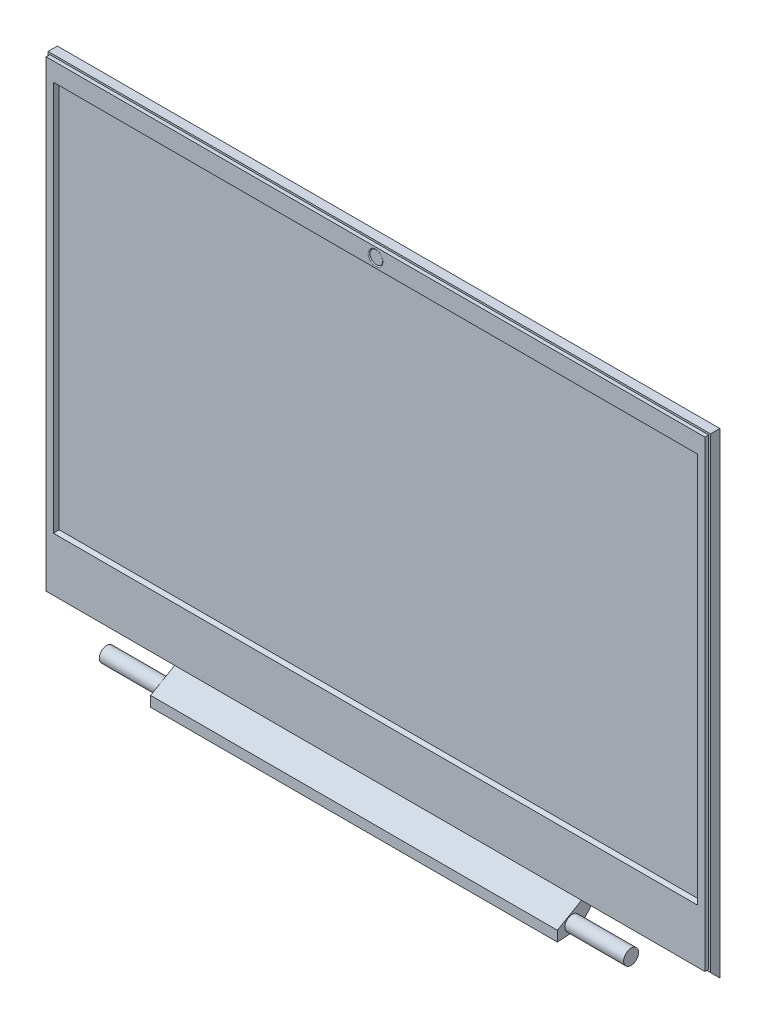
ISO-10303-21;
HEADER;
FILE_DESCRIPTION(('STEP AP214'),'2;1');
FILE_NAME('part.step','',(''),(''),'','','');
FILE_SCHEMA(('AUTOMOTIVE_DESIGN { 1 0 10303 214 1 1 1 1 }'));
ENDSEC;
DATA;
#1=APPLICATION_CONTEXT('core data for automotive mechanical design processes');
#2=APPLICATION_PROTOCOL_DEFINITION('international standard','automotive_design',2000,#1);
#3=PRODUCT_CONTEXT('',#1,'mechanical');
#4=PRODUCT('Part','Part','',(#3));
#5=PRODUCT_RELATED_PRODUCT_CATEGORY('part','',(#4));
#6=PRODUCT_DEFINITION_FORMATION('','',#4);
#7=PRODUCT_DEFINITION_CONTEXT('part definition',#1,'design');
#8=PRODUCT_DEFINITION('design','',#6,#7);
#9=PRODUCT_DEFINITION_SHAPE('','',#8);
#10=(LENGTH_UNIT() NAMED_UNIT(*) SI_UNIT(.MILLI.,.METRE.));
#11=(NAMED_UNIT(*) PLANE_ANGLE_UNIT() SI_UNIT($,.RADIAN.));
#12=(NAMED_UNIT(*) SI_UNIT($,.STERADIAN.) SOLID_ANGLE_UNIT());
#13=UNCERTAINTY_MEASURE_WITH_UNIT(LENGTH_MEASURE(1.E-05),#10,'distance_accuracy_value','');
#14=(GEOMETRIC_REPRESENTATION_CONTEXT(3) GLOBAL_UNCERTAINTY_ASSIGNED_CONTEXT((#13)) GLOBAL_UNIT_ASSIGNED_CONTEXT((#10,
#11,#12)) REPRESENTATION_CONTEXT('',''));
#15=CARTESIAN_POINT('',(0.,0.,0.));
#16=DIRECTION('',(0.,0.,1.));
#17=DIRECTION('',(1.,0.,0.));
#18=AXIS2_PLACEMENT_3D('',#15,#16,#17);
#19=CARTESIAN_POINT('',(177.5,255.,0.));
#20=DIRECTION('',(0.,-1.,0.));
#21=DIRECTION('',(0.,0.,-1.));
#22=AXIS2_PLACEMENT_3D('',#19,#20,#21);
#23=PLANE('',#22);
#24=DIRECTION('',(-1.,0.,0.));
#25=VECTOR('',#24,1.);
#26=CARTESIAN_POINT('',(177.5,255.,4.99999999999997));
#27=LINE('',#26,#25);
#28=CARTESIAN_POINT('',(177.5,255.,4.99999999999997));
#29=VERTEX_POINT('',#28);
#30=CARTESIAN_POINT('',(-177.5,255.,4.99999999999997));
#31=VERTEX_POINT('',#30);
#32=EDGE_CURVE('E294',#29,#31,#27,.T.);
#33=ORIENTED_EDGE('',*,*,#32,.F.);
#34=DIRECTION('',(0.,0.,1.));
#35=VECTOR('',#34,1.);
#36=CARTESIAN_POINT('',(177.5,255.,0.));
#37=LINE('',#36,#35);
#38=CARTESIAN_POINT('',(177.5,255.,0.));
#39=VERTEX_POINT('',#38);
#40=EDGE_CURVE('E363',#39,#29,#37,.T.);
#41=ORIENTED_EDGE('',*,*,#40,.F.);
#42=DIRECTION('',(-1.,0.,0.));
#43=VECTOR('',#42,1.);
#44=CARTESIAN_POINT('',(177.5,255.,0.));
#45=LINE('',#44,#43);
#46=CARTESIAN_POINT('',(-177.5,255.,0.));
#47=VERTEX_POINT('',#46);
#48=EDGE_CURVE('E381',#39,#47,#45,.T.);
#49=ORIENTED_EDGE('',*,*,#48,.T.);
#50=DIRECTION('',(0.,0.,1.));
#51=VECTOR('',#50,1.);
#52=CARTESIAN_POINT('',(-177.5,255.,0.));
#53=LINE('',#52,#51);
#54=EDGE_CURVE('E360',#47,#31,#53,.T.);
#55=ORIENTED_EDGE('',*,*,#54,.T.);
#56=EDGE_LOOP('',(#33,#41,#49,#55));
#57=FACE_BOUND('',#56,.T.);
#58=ADVANCED_FACE('F65',(#57),#23,.F.);
#59=CARTESIAN_POINT('',(177.5,0.,0.));
#60=DIRECTION('',(1.,0.,0.));
#61=DIRECTION('',(0.,0.,-1.));
#62=AXIS2_PLACEMENT_3D('',#59,#60,#61);
#63=PLANE('',#62);
#64=ORIENTED_EDGE('',*,*,#40,.T.);
#65=DIRECTION('',(0.,1.,0.));
#66=VECTOR('',#65,1.);
#67=CARTESIAN_POINT('',(177.5,4.99999999999995,4.99999999999997));
#68=LINE('',#67,#66);
#69=CARTESIAN_POINT('',(177.5,4.99999999999995,4.99999999999997));
#70=VERTEX_POINT('',#69);
#71=EDGE_CURVE('E282',#70,#29,#68,.T.);
#72=ORIENTED_EDGE('',*,*,#71,.F.);
#73=DIRECTION('',(0.,-0.707106781186546,-0.707106781186549));
#74=VECTOR('',#73,1.);
#75=CARTESIAN_POINT('',(177.5,4.99999999999995,4.99999999999997));
#76=LINE('',#75,#74);
#77=CARTESIAN_POINT('',(177.5,0.,0.));
#78=VERTEX_POINT('',#77);
#79=EDGE_CURVE('E355',#70,#78,#76,.T.);
#80=ORIENTED_EDGE('',*,*,#79,.T.);
#81=DIRECTION('',(0.,1.,0.));
#82=VECTOR('',#81,1.);
#83=CARTESIAN_POINT('',(177.5,0.,0.));
#84=LINE('',#83,#82);
#85=EDGE_CURVE('E359',#78,#39,#84,.T.);
#86=ORIENTED_EDGE('',*,*,#85,.T.);
#87=EDGE_LOOP('',(#64,#72,#80,#86));
#88=FACE_BOUND('',#87,.T.);
#89=ADVANCED_FACE('F463',(#88),#63,.T.);
#90=CARTESIAN_POINT('',(-177.5,0.,0.));
#91=DIRECTION('',(1.,0.,0.));
#92=DIRECTION('',(0.,0.,-1.));
#93=AXIS2_PLACEMENT_3D('',#90,#91,#92);
#94=PLANE('',#93);
#95=DIRECTION('',(0.,-1.,0.));
#96=VECTOR('',#95,1.);
#97=CARTESIAN_POINT('',(-177.5,255.,4.99999999999997));
#98=LINE('',#97,#96);
#99=CARTESIAN_POINT('',(-177.5,4.99999999999995,4.99999999999997));
#100=VERTEX_POINT('',#99);
#101=EDGE_CURVE('E297',#31,#100,#98,.T.);
#102=ORIENTED_EDGE('',*,*,#101,.F.);
#103=ORIENTED_EDGE('',*,*,#54,.F.);
#104=DIRECTION('',(0.,1.,0.));
#105=VECTOR('',#104,1.);
#106=CARTESIAN_POINT('',(-177.5,0.,0.));
#107=LINE('',#106,#105);
#108=CARTESIAN_POINT('',(-177.5,0.,0.));
#109=VERTEX_POINT('',#108);
#110=EDGE_CURVE('E371',#109,#47,#107,.T.);
#111=ORIENTED_EDGE('',*,*,#110,.F.);
#112=DIRECTION('',(0.,-0.707106781186546,-0.707106781186549));
#113=VECTOR('',#112,1.);
#114=CARTESIAN_POINT('',(-177.5,4.99999999999995,4.99999999999997));
#115=LINE('',#114,#113);
#116=EDGE_CURVE('E354',#100,#109,#115,.T.);
#117=ORIENTED_EDGE('',*,*,#116,.F.);
#118=EDGE_LOOP('',(#102,#103,#111,#117));
#119=FACE_BOUND('',#118,.T.);
#120=ADVANCED_FACE('F469',(#119),#94,.F.);
#121=CARTESIAN_POINT('',(177.5,4.99999999999995,4.99999999999997));
#122=DIRECTION('',(0.,0.707106781186549,-0.707106781186546));
#123=DIRECTION('',(0.,0.707106781186546,0.707106781186549));
#124=AXIS2_PLACEMENT_3D('',#121,#122,#123);
#125=PLANE('',#124);
#126=DIRECTION('',(0.,0.707106781186546,0.707106781186549));
#127=VECTOR('',#126,1.);
#128=CARTESIAN_POINT('',(109.,4.99999999999995,4.99999999999997));
#129=LINE('',#128,#127);
#130=CARTESIAN_POINT('',(109.,0.,0.));
#131=VERTEX_POINT('',#130);
#132=CARTESIAN_POINT('',(109.,4.99999999999995,4.99999999999997));
#133=VERTEX_POINT('',#132);
#134=EDGE_CURVE('E301',#131,#133,#129,.T.);
#135=ORIENTED_EDGE('',*,*,#134,.F.);
#136=DIRECTION('',(-1.,0.,0.));
#137=VECTOR('',#136,1.);
#138=CARTESIAN_POINT('',(177.5,0.,0.));
#139=LINE('',#138,#137);
#140=EDGE_CURVE('E386',#78,#131,#139,.T.);
#141=ORIENTED_EDGE('',*,*,#140,.F.);
#142=ORIENTED_EDGE('',*,*,#79,.F.);
#143=DIRECTION('',(-1.,0.,0.));
#144=VECTOR('',#143,1.);
#145=CARTESIAN_POINT('',(177.5,4.99999999999995,4.99999999999997));
#146=LINE('',#145,#144);
#147=EDGE_CURVE('E377',#70,#133,#146,.T.);
#148=ORIENTED_EDGE('',*,*,#147,.T.);
#149=EDGE_LOOP('',(#135,#141,#142,#148));
#150=FACE_BOUND('',#149,.T.);
#151=ADVANCED_FACE('F483',(#150),#125,.F.);
#152=CARTESIAN_POINT('',(-109.,0.,0.));
#153=VERTEX_POINT('',#152);
#154=EDGE_CURVE('E385',#153,#109,#139,.T.);
#155=ORIENTED_EDGE('',*,*,#154,.F.);
#156=DIRECTION('',(0.,0.707106781186546,0.707106781186549));
#157=VECTOR('',#156,1.);
#158=CARTESIAN_POINT('',(-109.,4.99999999999995,4.99999999999997));
#159=LINE('',#158,#157);
#160=CARTESIAN_POINT('',(-109.,4.99999999999995,4.99999999999997));
#161=VERTEX_POINT('',#160);
#162=EDGE_CURVE('E300',#153,#161,#159,.T.);
#163=ORIENTED_EDGE('',*,*,#162,.T.);
#164=EDGE_CURVE('E367',#161,#100,#146,.T.);
#165=ORIENTED_EDGE('',*,*,#164,.T.);
#166=ORIENTED_EDGE('',*,*,#116,.T.);
#167=EDGE_LOOP('',(#155,#163,#165,#166));
#168=FACE_BOUND('',#167,.T.);
#169=ADVANCED_FACE('F479',(#168),#125,.F.);
#170=CARTESIAN_POINT('',(177.5,0.,0.));
#171=DIRECTION('',(0.,0.,1.));
#172=DIRECTION('',(1.,0.,0.));
#173=AXIS2_PLACEMENT_3D('',#170,#171,#172);
#174=PLANE('',#173);
#175=ORIENTED_EDGE('',*,*,#110,.T.);
#176=ORIENTED_EDGE('',*,*,#48,.F.);
#177=ORIENTED_EDGE('',*,*,#85,.F.);
#178=ORIENTED_EDGE('',*,*,#140,.T.);
#179=DIRECTION('',(-1.,0.,0.));
#180=VECTOR('',#179,1.);
#181=CARTESIAN_POINT('',(109.,0.,0.));
#182=LINE('',#181,#180);
#183=EDGE_CURVE('E319',#131,#153,#182,.T.);
#184=ORIENTED_EDGE('',*,*,#183,.T.);
#185=ORIENTED_EDGE('',*,*,#154,.T.);
#186=EDGE_LOOP('',(#175,#176,#177,#178,#184,#185));
#187=FACE_BOUND('',#186,.T.);
#188=ADVANCED_FACE('F475',(#187),#174,.F.);
#189=CARTESIAN_POINT('',(109.,-2.82716426046485,18.5570461783121));
#190=DIRECTION('',(0.,-0.866025403784436,-0.500000000000004));
#191=DIRECTION('',(0.,0.500000000000004,-0.866025403784436));
#192=AXIS2_PLACEMENT_3D('',#189,#190,#191);
#193=PLANE('',#192);
#194=DIRECTION('',(0.,-0.500000000000004,0.866025403784436));
#195=VECTOR('',#194,1.);
#196=CARTESIAN_POINT('',(-109.,-2.82716426046485,18.5570461783121));
#197=LINE('',#196,#195);
#198=CARTESIAN_POINT('',(-109.,-2.82716426046485,18.5570461783121));
#199=VERTEX_POINT('',#198);
#200=EDGE_CURVE('E323',#161,#199,#197,.T.);
#201=ORIENTED_EDGE('',*,*,#200,.T.);
#202=DIRECTION('',(-1.,0.,0.));
#203=VECTOR('',#202,1.);
#204=CARTESIAN_POINT('',(109.,-2.82716426046485,18.5570461783121));
#205=LINE('',#204,#203);
#206=CARTESIAN_POINT('',(109.,-2.82716426046485,18.5570461783121));
#207=VERTEX_POINT('',#206);
#208=EDGE_CURVE('E346',#207,#199,#205,.T.);
#209=ORIENTED_EDGE('',*,*,#208,.F.);
#210=DIRECTION('',(0.,-0.500000000000004,0.866025403784436));
#211=VECTOR('',#210,1.);
#212=CARTESIAN_POINT('',(109.,-2.82716426046485,18.5570461783121));
#213=LINE('',#212,#211);
#214=EDGE_CURVE('E305',#133,#207,#213,.T.);
#215=ORIENTED_EDGE('',*,*,#214,.F.);
#216=DIRECTION('',(-1.,0.,0.));
#217=VECTOR('',#216,1.);
#218=CARTESIAN_POINT('',(109.,4.99999999999995,4.99999999999997));
#219=LINE('',#218,#217);
#220=EDGE_CURVE('E350',#133,#161,#219,.T.);
#221=ORIENTED_EDGE('',*,*,#220,.T.);
#222=EDGE_LOOP('',(#201,#209,#215,#221));
#223=FACE_BOUND('',#222,.T.);
#224=ADVANCED_FACE('F478',(#223),#193,.F.);
#225=CARTESIAN_POINT('',(109.,-8.32716426046485,18.5570461783121));
#226=DIRECTION('',(0.,0.,-1.));
#227=DIRECTION('',(-1.,0.,0.));
#228=AXIS2_PLACEMENT_3D('',#225,#226,#227);
#229=PLANE('',#228);
#230=DIRECTION('',(0.,-1.,0.));
#231=VECTOR('',#230,1.);
#232=CARTESIAN_POINT('',(-109.,-8.32716426046485,18.5570461783121));
#233=LINE('',#232,#231);
#234=CARTESIAN_POINT('',(-109.,-8.32716426046485,18.5570461783121));
#235=VERTEX_POINT('',#234);
#236=EDGE_CURVE('E326',#199,#235,#233,.T.);
#237=ORIENTED_EDGE('',*,*,#236,.T.);
#238=DIRECTION('',(-1.,0.,0.));
#239=VECTOR('',#238,1.);
#240=CARTESIAN_POINT('',(109.,-8.32716426046485,18.5570461783121));
#241=LINE('',#240,#239);
#242=CARTESIAN_POINT('',(109.,-8.32716426046485,18.5570461783121));
#243=VERTEX_POINT('',#242);
#244=EDGE_CURVE('E342',#243,#235,#241,.T.);
#245=ORIENTED_EDGE('',*,*,#244,.F.);
#246=DIRECTION('',(0.,-1.,0.));
#247=VECTOR('',#246,1.);
#248=CARTESIAN_POINT('',(109.,-8.32716426046485,18.5570461783121));
#249=LINE('',#248,#247);
#250=EDGE_CURVE('E309',#207,#243,#249,.T.);
#251=ORIENTED_EDGE('',*,*,#250,.F.);
#252=ORIENTED_EDGE('',*,*,#208,.T.);
#253=EDGE_LOOP('',(#237,#245,#251,#252));
#254=FACE_BOUND('',#253,.T.);
#255=ADVANCED_FACE('F575',(#254),#229,.F.);
#256=CARTESIAN_POINT('',(109.,-7.52689139364863,6.58376077543969));
#257=DIRECTION('',(0.,0.997773783572702,0.0666894055680182));
#258=DIRECTION('',(0.,-0.0666894055680182,0.997773783572702));
#259=AXIS2_PLACEMENT_3D('',#256,#257,#258);
#260=PLANE('',#259);
#261=DIRECTION('',(0.,0.0666894055680182,-0.997773783572702));
#262=VECTOR('',#261,1.);
#263=CARTESIAN_POINT('',(-109.,-7.52689139364863,6.58376077543969));
#264=LINE('',#263,#262);
#265=CARTESIAN_POINT('',(-109.,-7.52689139364863,6.58376077543969));
#266=VERTEX_POINT('',#265);
#267=EDGE_CURVE('E329',#235,#266,#264,.T.);
#268=ORIENTED_EDGE('',*,*,#267,.T.);
#269=DIRECTION('',(-1.,0.,0.));
#270=VECTOR('',#269,1.);
#271=CARTESIAN_POINT('',(109.,-7.52689139364863,6.58376077543969));
#272=LINE('',#271,#270);
#273=CARTESIAN_POINT('',(109.,-7.52689139364863,6.58376077543969));
#274=VERTEX_POINT('',#273);
#275=EDGE_CURVE('E338',#274,#266,#272,.T.);
#276=ORIENTED_EDGE('',*,*,#275,.F.);
#277=DIRECTION('',(0.,0.0666894055680182,-0.997773783572702));
#278=VECTOR('',#277,1.);
#279=CARTESIAN_POINT('',(109.,-7.52689139364863,6.58376077543969));
#280=LINE('',#279,#278);
#281=EDGE_CURVE('E312',#243,#274,#280,.T.);
#282=ORIENTED_EDGE('',*,*,#281,.F.);
#283=ORIENTED_EDGE('',*,*,#244,.T.);
#284=EDGE_LOOP('',(#268,#276,#282,#283));
#285=FACE_BOUND('',#284,.T.);
#286=ADVANCED_FACE('F571',(#285),#260,.F.);
#287=CARTESIAN_POINT('',(109.,0.,0.));
#288=DIRECTION('',(0.,0.658376077543969,0.752689139364862));
#289=DIRECTION('',(0.,-0.752689139364863,0.658376077543969));
#290=AXIS2_PLACEMENT_3D('',#287,#288,#289);
#291=PLANE('',#290);
#292=DIRECTION('',(0.,0.752689139364863,-0.658376077543969));
#293=VECTOR('',#292,1.);
#294=CARTESIAN_POINT('',(-109.,0.,0.));
#295=LINE('',#294,#293);
#296=EDGE_CURVE('E306',#266,#153,#295,.T.);
#297=ORIENTED_EDGE('',*,*,#296,.T.);
#298=ORIENTED_EDGE('',*,*,#183,.F.);
#299=DIRECTION('',(0.,0.752689139364863,-0.658376077543969));
#300=VECTOR('',#299,1.);
#301=CARTESIAN_POINT('',(109.,0.,0.));
#302=LINE('',#301,#300);
#303=EDGE_CURVE('E315',#274,#131,#302,.T.);
#304=ORIENTED_EDGE('',*,*,#303,.F.);
#305=ORIENTED_EDGE('',*,*,#275,.T.);
#306=EDGE_LOOP('',(#297,#298,#304,#305));
#307=FACE_BOUND('',#306,.T.);
#308=ADVANCED_FACE('F565',(#307),#291,.F.);
#309=CARTESIAN_POINT('',(109.,0.,0.));
#310=DIRECTION('',(-1.,0.,0.));
#311=DIRECTION('',(0.,0.,1.));
#312=AXIS2_PLACEMENT_3D('',#309,#310,#311);
#313=PLANE('',#312);
#314=CARTESIAN_POINT('',(109.,-3.38264143798815,10.5570461783121));
#315=DIRECTION('',(-1.,0.,0.));
#316=DIRECTION('',(0.,0.,1.));
#317=AXIS2_PLACEMENT_3D('',#314,#315,#316);
#318=CIRCLE('',#317,4.);
#319=CARTESIAN_POINT('',(109.,-3.38264143798815,14.5570461783121));
#320=VERTEX_POINT('',#319);
#321=EDGE_CURVE('E12',#320,#320,#318,.F.);
#322=ORIENTED_EDGE('',*,*,#321,.F.);
#323=EDGE_LOOP('',(#322));
#324=FACE_BOUND('',#323,.T.);
#325=ORIENTED_EDGE('',*,*,#134,.T.);
#326=ORIENTED_EDGE('',*,*,#214,.T.);
#327=ORIENTED_EDGE('',*,*,#250,.T.);
#328=ORIENTED_EDGE('',*,*,#281,.T.);
#329=ORIENTED_EDGE('',*,*,#303,.T.);
#330=EDGE_LOOP('',(#325,#326,#327,#328,#329));
#331=FACE_BOUND('',#330,.T.);
#332=ADVANCED_FACE('F562',(#324,#331),#313,.F.);
#333=CARTESIAN_POINT('',(-109.,0.,0.));
#334=DIRECTION('',(-1.,0.,0.));
#335=DIRECTION('',(0.,0.,1.));
#336=AXIS2_PLACEMENT_3D('',#333,#334,#335);
#337=PLANE('',#336);
#338=CARTESIAN_POINT('',(-109.,-3.38264143798815,10.5570461783121));
#339=DIRECTION('',(-1.,0.,0.));
#340=DIRECTION('',(0.,0.,1.));
#341=AXIS2_PLACEMENT_3D('',#338,#339,#340);
#342=CIRCLE('',#341,4.);
#343=CARTESIAN_POINT('',(-109.,-3.38264143798815,14.5570461783121));
#344=VERTEX_POINT('',#343);
#345=EDGE_CURVE('E69',#344,#344,#342,.F.);
#346=ORIENTED_EDGE('',*,*,#345,.T.);
#347=EDGE_LOOP('',(#346));
#348=FACE_BOUND('',#347,.T.);
#349=ORIENTED_EDGE('',*,*,#162,.F.);
#350=ORIENTED_EDGE('',*,*,#296,.F.);
#351=ORIENTED_EDGE('',*,*,#267,.F.);
#352=ORIENTED_EDGE('',*,*,#236,.F.);
#353=ORIENTED_EDGE('',*,*,#200,.F.);
#354=EDGE_LOOP('',(#349,#350,#351,#352,#353));
#355=FACE_BOUND('',#354,.T.);
#356=ADVANCED_FACE('F558',(#348,#355),#337,.T.);
#357=CARTESIAN_POINT('',(0.,0.,4.99999999999997));
#358=DIRECTION('',(0.,0.,1.));
#359=DIRECTION('',(1.,0.,0.));
#360=AXIS2_PLACEMENT_3D('',#357,#358,#359);
#361=PLANE('',#360);
#362=DIRECTION('',(1.,0.,0.));
#363=VECTOR('',#362,1.);
#364=CARTESIAN_POINT('',(-177.5,5.99999999999995,4.99999999999997));
#365=LINE('',#364,#363);
#366=CARTESIAN_POINT('',(-176.5,5.99999999999995,4.99999999999997));
#367=VERTEX_POINT('',#366);
#368=CARTESIAN_POINT('',(176.5,5.99999999999995,4.99999999999997));
#369=VERTEX_POINT('',#368);
#370=EDGE_CURVE('E260',#367,#369,#365,.T.);
#371=ORIENTED_EDGE('',*,*,#370,.F.);
#372=DIRECTION('',(0.,-1.,0.));
#373=VECTOR('',#372,1.);
#374=CARTESIAN_POINT('',(-176.5,255.,4.99999999999997));
#375=LINE('',#374,#373);
#376=CARTESIAN_POINT('',(-176.5,254.,4.99999999999997));
#377=VERTEX_POINT('',#376);
#378=EDGE_CURVE('E256',#377,#367,#375,.T.);
#379=ORIENTED_EDGE('',*,*,#378,.F.);
#380=DIRECTION('',(-1.,0.,0.));
#381=VECTOR('',#380,1.);
#382=CARTESIAN_POINT('',(177.5,254.,4.99999999999997));
#383=LINE('',#382,#381);
#384=CARTESIAN_POINT('',(176.5,254.,4.99999999999997));
#385=VERTEX_POINT('',#384);
#386=EDGE_CURVE('E251',#385,#377,#383,.T.);
#387=ORIENTED_EDGE('',*,*,#386,.F.);
#388=DIRECTION('',(0.,1.,0.));
#389=VECTOR('',#388,1.);
#390=CARTESIAN_POINT('',(176.5,4.99999999999995,4.99999999999997));
#391=LINE('',#390,#389);
#392=EDGE_CURVE('E247',#369,#385,#391,.T.);
#393=ORIENTED_EDGE('',*,*,#392,.F.);
#394=EDGE_LOOP('',(#371,#379,#387,#393));
#395=FACE_BOUND('',#394,.T.);
#396=ORIENTED_EDGE('',*,*,#71,.T.);
#397=ORIENTED_EDGE('',*,*,#32,.T.);
#398=ORIENTED_EDGE('',*,*,#101,.T.);
#399=ORIENTED_EDGE('',*,*,#164,.F.);
#400=ORIENTED_EDGE('',*,*,#220,.F.);
#401=ORIENTED_EDGE('',*,*,#147,.F.);
#402=EDGE_LOOP('',(#396,#397,#398,#399,#400,#401));
#403=FACE_BOUND('',#402,.T.);
#404=ADVANCED_FACE('F554',(#395,#403),#361,.T.);
#405=CARTESIAN_POINT('',(176.5,4.99999999999995,4.99999999999997));
#406=DIRECTION('',(1.,0.,0.));
#407=DIRECTION('',(0.,0.,-1.));
#408=AXIS2_PLACEMENT_3D('',#405,#406,#407);
#409=PLANE('',#408);
#410=DIRECTION('',(0.,1.,0.));
#411=VECTOR('',#410,1.);
#412=CARTESIAN_POINT('',(176.5,4.99999999999995,6.99999999999997));
#413=LINE('',#412,#411);
#414=CARTESIAN_POINT('',(176.5,5.99999999999995,6.99999999999997));
#415=VERTEX_POINT('',#414);
#416=CARTESIAN_POINT('',(176.5,254.,6.99999999999997));
#417=VERTEX_POINT('',#416);
#418=EDGE_CURVE('E241',#415,#417,#413,.T.);
#419=ORIENTED_EDGE('',*,*,#418,.F.);
#420=DIRECTION('',(0.,0.,1.));
#421=VECTOR('',#420,1.);
#422=CARTESIAN_POINT('',(176.5,5.99999999999995,4.99999999999997));
#423=LINE('',#422,#421);
#424=EDGE_CURVE('E279',#369,#415,#423,.T.);
#425=ORIENTED_EDGE('',*,*,#424,.F.);
#426=ORIENTED_EDGE('',*,*,#392,.T.);
#427=DIRECTION('',(0.,0.,1.));
#428=VECTOR('',#427,1.);
#429=CARTESIAN_POINT('',(176.5,254.,4.99999999999997));
#430=LINE('',#429,#428);
#431=EDGE_CURVE('E264',#385,#417,#430,.T.);
#432=ORIENTED_EDGE('',*,*,#431,.T.);
#433=EDGE_LOOP('',(#419,#425,#426,#432));
#434=FACE_BOUND('',#433,.T.);
#435=ADVANCED_FACE('F543',(#434),#409,.T.);
#436=CARTESIAN_POINT('',(-177.5,5.99999999999995,4.99999999999997));
#437=DIRECTION('',(0.,-1.,0.));
#438=DIRECTION('',(0.,0.,-1.));
#439=AXIS2_PLACEMENT_3D('',#436,#437,#438);
#440=PLANE('',#439);
#441=DIRECTION('',(1.,0.,0.));
#442=VECTOR('',#441,1.);
#443=CARTESIAN_POINT('',(-177.5,5.99999999999995,6.99999999999997));
#444=LINE('',#443,#442);
#445=CARTESIAN_POINT('',(-176.5,5.99999999999995,6.99999999999997));
#446=VERTEX_POINT('',#445);
#447=EDGE_CURVE('E252',#446,#415,#444,.T.);
#448=ORIENTED_EDGE('',*,*,#447,.F.);
#449=DIRECTION('',(0.,0.,1.));
#450=VECTOR('',#449,1.);
#451=CARTESIAN_POINT('',(-176.5,5.99999999999995,4.99999999999997));
#452=LINE('',#451,#450);
#453=EDGE_CURVE('E283',#367,#446,#452,.T.);
#454=ORIENTED_EDGE('',*,*,#453,.F.);
#455=ORIENTED_EDGE('',*,*,#370,.T.);
#456=ORIENTED_EDGE('',*,*,#424,.T.);
#457=EDGE_LOOP('',(#448,#454,#455,#456));
#458=FACE_BOUND('',#457,.T.);
#459=ADVANCED_FACE('F539',(#458),#440,.T.);
#460=CARTESIAN_POINT('',(-176.5,255.,4.99999999999997));
#461=DIRECTION('',(-1.,0.,0.));
#462=DIRECTION('',(0.,0.,1.));
#463=AXIS2_PLACEMENT_3D('',#460,#461,#462);
#464=PLANE('',#463);
#465=DIRECTION('',(0.,-1.,0.));
#466=VECTOR('',#465,1.);
#467=CARTESIAN_POINT('',(-176.5,255.,6.99999999999997));
#468=LINE('',#467,#466);
#469=CARTESIAN_POINT('',(-176.5,254.,6.99999999999997));
#470=VERTEX_POINT('',#469);
#471=EDGE_CURVE('E272',#470,#446,#468,.T.);
#472=ORIENTED_EDGE('',*,*,#471,.F.);
#473=DIRECTION('',(0.,0.,1.));
#474=VECTOR('',#473,1.);
#475=CARTESIAN_POINT('',(-176.5,254.,4.99999999999997));
#476=LINE('',#475,#474);
#477=EDGE_CURVE('E286',#377,#470,#476,.T.);
#478=ORIENTED_EDGE('',*,*,#477,.F.);
#479=ORIENTED_EDGE('',*,*,#378,.T.);
#480=ORIENTED_EDGE('',*,*,#453,.T.);
#481=EDGE_LOOP('',(#472,#478,#479,#480));
#482=FACE_BOUND('',#481,.T.);
#483=ADVANCED_FACE('F542',(#482),#464,.T.);
#484=CARTESIAN_POINT('',(177.5,254.,4.99999999999997));
#485=DIRECTION('',(0.,1.,0.));
#486=DIRECTION('',(0.,0.,1.));
#487=AXIS2_PLACEMENT_3D('',#484,#485,#486);
#488=PLANE('',#487);
#489=DIRECTION('',(-1.,0.,0.));
#490=VECTOR('',#489,1.);
#491=CARTESIAN_POINT('',(177.5,254.,6.99999999999997));
#492=LINE('',#491,#490);
#493=EDGE_CURVE('E268',#417,#470,#492,.T.);
#494=ORIENTED_EDGE('',*,*,#493,.F.);
#495=ORIENTED_EDGE('',*,*,#431,.F.);
#496=ORIENTED_EDGE('',*,*,#386,.T.);
#497=ORIENTED_EDGE('',*,*,#477,.T.);
#498=EDGE_LOOP('',(#494,#495,#496,#497));
#499=FACE_BOUND('',#498,.T.);
#500=ADVANCED_FACE('F547',(#499),#488,.T.);
#501=CARTESIAN_POINT('',(0.,0.,6.99999999999997));
#502=DIRECTION('',(0.,0.,1.));
#503=DIRECTION('',(1.,0.,0.));
#504=AXIS2_PLACEMENT_3D('',#501,#502,#503);
#505=PLANE('',#504);
#506=CARTESIAN_POINT('',(0.,249.,6.99999999999997));
#507=DIRECTION('',(0.,0.,1.));
#508=DIRECTION('',(1.,0.,0.));
#509=AXIS2_PLACEMENT_3D('',#506,#507,#508);
#510=CIRCLE('',#509,4.);
#511=CARTESIAN_POINT('',(4.,249.,6.99999999999997));
#512=VERTEX_POINT('',#511);
#513=EDGE_CURVE('E75',#512,#512,#510,.F.);
#514=ORIENTED_EDGE('',*,*,#513,.T.);
#515=EDGE_LOOP('',(#514));
#516=FACE_BOUND('',#515,.T.);
#517=DIRECTION('',(-1.,0.,0.));
#518=VECTOR('',#517,1.);
#519=CARTESIAN_POINT('',(-171.5,34.846,6.99999999999997));
#520=LINE('',#519,#518);
#521=CARTESIAN_POINT('',(172.654,34.846,6.99999999999997));
#522=VERTEX_POINT('',#521);
#523=CARTESIAN_POINT('',(-172.654,34.846,6.99999999999997));
#524=VERTEX_POINT('',#523);
#525=EDGE_CURVE('E392',#522,#524,#520,.T.);
#526=ORIENTED_EDGE('',*,*,#525,.T.);
#527=DIRECTION('',(0.,1.,0.));
#528=VECTOR('',#527,1.);
#529=CARTESIAN_POINT('',(-172.654,243.,6.99999999999997));
#530=LINE('',#529,#528);
#531=CARTESIAN_POINT('',(-172.654,244.154,6.99999999999997));
#532=VERTEX_POINT('',#531);
#533=EDGE_CURVE('E401',#524,#532,#530,.T.);
#534=ORIENTED_EDGE('',*,*,#533,.T.);
#535=DIRECTION('',(1.,0.,0.));
#536=VECTOR('',#535,1.);
#537=CARTESIAN_POINT('',(171.5,244.154,6.99999999999997));
#538=LINE('',#537,#536);
#539=CARTESIAN_POINT('',(172.654,244.154,6.99999999999997));
#540=VERTEX_POINT('',#539);
#541=EDGE_CURVE('E398',#532,#540,#538,.T.);
#542=ORIENTED_EDGE('',*,*,#541,.T.);
#543=DIRECTION('',(0.,-1.,0.));
#544=VECTOR('',#543,1.);
#545=CARTESIAN_POINT('',(172.654,36.,6.99999999999997));
#546=LINE('',#545,#544);
#547=EDGE_CURVE('E395',#540,#522,#546,.T.);
#548=ORIENTED_EDGE('',*,*,#547,.T.);
#549=EDGE_LOOP('',(#526,#534,#542,#548));
#550=FACE_BOUND('',#549,.T.);
#551=ORIENTED_EDGE('',*,*,#447,.T.);
#552=ORIENTED_EDGE('',*,*,#418,.T.);
#553=ORIENTED_EDGE('',*,*,#493,.T.);
#554=ORIENTED_EDGE('',*,*,#471,.T.);
#555=EDGE_LOOP('',(#551,#552,#553,#554));
#556=FACE_BOUND('',#555,.T.);
#557=ADVANCED_FACE('F424',(#516,#550,#556),#505,.T.);
#558=CARTESIAN_POINT('',(-171.5,36.,4.99999999999997));
#559=DIRECTION('',(-1.,0.,0.));
#560=DIRECTION('',(0.,0.,1.));
#561=AXIS2_PLACEMENT_3D('',#558,#559,#560);
#562=PLANE('',#561);
#563=DIRECTION('',(0.,0.,1.));
#564=VECTOR('',#563,1.);
#565=CARTESIAN_POINT('',(-171.5,243.,4.99999999999997));
#566=LINE('',#565,#564);
#567=CARTESIAN_POINT('',(-171.5,243.,4.99999999999997));
#568=VERTEX_POINT('',#567);
#569=CARTESIAN_POINT('',(-171.5,243.,5.00121336806555));
#570=VERTEX_POINT('',#569);
#571=EDGE_CURVE('E238',#568,#570,#566,.T.);
#572=ORIENTED_EDGE('',*,*,#571,.T.);
#573=DIRECTION('',(0.,-1.,0.));
#574=VECTOR('',#573,1.);
#575=CARTESIAN_POINT('',(-171.5,36.,5.00121336806555));
#576=LINE('',#575,#574);
#577=CARTESIAN_POINT('',(-171.5,36.,5.00121336806555));
#578=VERTEX_POINT('',#577);
#579=EDGE_CURVE('E208',#570,#578,#576,.T.);
#580=ORIENTED_EDGE('',*,*,#579,.T.);
#581=DIRECTION('',(0.,0.,1.));
#582=VECTOR('',#581,1.);
#583=CARTESIAN_POINT('',(-171.5,36.,4.99999999999997));
#584=LINE('',#583,#582);
#585=CARTESIAN_POINT('',(-171.5,36.,4.99999999999997));
#586=VERTEX_POINT('',#585);
#587=EDGE_CURVE('E200',#586,#578,#584,.T.);
#588=ORIENTED_EDGE('',*,*,#587,.F.);
#589=DIRECTION('',(0.,-1.,0.));
#590=VECTOR('',#589,1.);
#591=CARTESIAN_POINT('',(-171.5,36.,4.99999999999997));
#592=LINE('',#591,#590);
#593=EDGE_CURVE('E205',#568,#586,#592,.T.);
#594=ORIENTED_EDGE('',*,*,#593,.F.);
#595=EDGE_LOOP('',(#572,#580,#588,#594));
#596=FACE_BOUND('',#595,.T.);
#597=ADVANCED_FACE('F203',(#596),#562,.F.);
#598=CARTESIAN_POINT('',(-171.5,243.,4.99999999999997));
#599=DIRECTION('',(0.,1.,0.));
#600=DIRECTION('',(0.,0.,1.));
#601=AXIS2_PLACEMENT_3D('',#598,#599,#600);
#602=PLANE('',#601);
#603=DIRECTION('',(0.,0.,1.));
#604=VECTOR('',#603,1.);
#605=CARTESIAN_POINT('',(171.5,243.,4.99999999999997));
#606=LINE('',#605,#604);
#607=CARTESIAN_POINT('',(171.5,243.,4.99999999999997));
#608=VERTEX_POINT('',#607);
#609=CARTESIAN_POINT('',(171.5,243.,5.00121336806555));
#610=VERTEX_POINT('',#609);
#611=EDGE_CURVE('E242',#608,#610,#606,.T.);
#612=ORIENTED_EDGE('',*,*,#611,.T.);
#613=DIRECTION('',(-1.,0.,0.));
#614=VECTOR('',#613,1.);
#615=CARTESIAN_POINT('',(-171.5,243.,5.00121336806555));
#616=LINE('',#615,#614);
#617=EDGE_CURVE('E405',#610,#570,#616,.T.);
#618=ORIENTED_EDGE('',*,*,#617,.T.);
#619=ORIENTED_EDGE('',*,*,#571,.F.);
#620=DIRECTION('',(-1.,0.,0.));
#621=VECTOR('',#620,1.);
#622=CARTESIAN_POINT('',(-171.5,243.,4.99999999999997));
#623=LINE('',#622,#621);
#624=EDGE_CURVE('E211',#608,#568,#623,.T.);
#625=ORIENTED_EDGE('',*,*,#624,.F.);
#626=EDGE_LOOP('',(#612,#618,#619,#625));
#627=FACE_BOUND('',#626,.T.);
#628=ADVANCED_FACE('F526',(#627),#602,.F.);
#629=CARTESIAN_POINT('',(171.5,36.,4.99999999999997));
#630=DIRECTION('',(1.,0.,0.));
#631=DIRECTION('',(0.,0.,-1.));
#632=AXIS2_PLACEMENT_3D('',#629,#630,#631);
#633=PLANE('',#632);
#634=DIRECTION('',(0.,0.,1.));
#635=VECTOR('',#634,1.);
#636=CARTESIAN_POINT('',(171.5,36.,4.99999999999997));
#637=LINE('',#636,#635);
#638=CARTESIAN_POINT('',(171.5,36.,4.99999999999997));
#639=VERTEX_POINT('',#638);
#640=CARTESIAN_POINT('',(171.5,36.,5.00121336806555));
#641=VERTEX_POINT('',#640);
#642=EDGE_CURVE('E210',#639,#641,#637,.T.);
#643=ORIENTED_EDGE('',*,*,#642,.T.);
#644=DIRECTION('',(0.,1.,0.));
#645=VECTOR('',#644,1.);
#646=CARTESIAN_POINT('',(171.5,243.,5.00121336806555));
#647=LINE('',#646,#645);
#648=EDGE_CURVE('E90',#641,#610,#647,.T.);
#649=ORIENTED_EDGE('',*,*,#648,.T.);
#650=ORIENTED_EDGE('',*,*,#611,.F.);
#651=DIRECTION('',(0.,1.,0.));
#652=VECTOR('',#651,1.);
#653=CARTESIAN_POINT('',(171.5,36.,4.99999999999997));
#654=LINE('',#653,#652);
#655=EDGE_CURVE('E220',#639,#608,#654,.T.);
#656=ORIENTED_EDGE('',*,*,#655,.F.);
#657=EDGE_LOOP('',(#643,#649,#650,#656));
#658=FACE_BOUND('',#657,.T.);
#659=ADVANCED_FACE('F527',(#658),#633,.F.);
#660=CARTESIAN_POINT('',(-171.5,36.,4.99999999999997));
#661=DIRECTION('',(0.,-1.,0.));
#662=DIRECTION('',(0.,0.,-1.));
#663=AXIS2_PLACEMENT_3D('',#660,#661,#662);
#664=PLANE('',#663);
#665=ORIENTED_EDGE('',*,*,#587,.T.);
#666=DIRECTION('',(1.,0.,0.));
#667=VECTOR('',#666,1.);
#668=CARTESIAN_POINT('',(171.5,36.,5.00121336806555));
#669=LINE('',#668,#667);
#670=EDGE_CURVE('E83',#578,#641,#669,.T.);
#671=ORIENTED_EDGE('',*,*,#670,.T.);
#672=ORIENTED_EDGE('',*,*,#642,.F.);
#673=DIRECTION('',(1.,0.,0.));
#674=VECTOR('',#673,1.);
#675=CARTESIAN_POINT('',(-171.5,36.,4.99999999999997));
#676=LINE('',#675,#674);
#677=EDGE_CURVE('E214',#586,#639,#676,.T.);
#678=ORIENTED_EDGE('',*,*,#677,.F.);
#679=EDGE_LOOP('',(#665,#671,#672,#678));
#680=FACE_BOUND('',#679,.T.);
#681=ADVANCED_FACE('F215',(#680),#664,.F.);
#682=CARTESIAN_POINT('',(0.,0.,4.99999999999997));
#683=DIRECTION('',(0.,0.,-1.));
#684=DIRECTION('',(-1.,0.,0.));
#685=AXIS2_PLACEMENT_3D('',#682,#683,#684);
#686=PLANE('',#685);
#687=ORIENTED_EDGE('',*,*,#593,.T.);
#688=ORIENTED_EDGE('',*,*,#677,.T.);
#689=ORIENTED_EDGE('',*,*,#655,.T.);
#690=ORIENTED_EDGE('',*,*,#624,.T.);
#691=EDGE_LOOP('',(#687,#688,#689,#690));
#692=FACE_BOUND('',#691,.T.);
#693=ADVANCED_FACE('F222',(#692),#686,.F.);
#694=CARTESIAN_POINT('',(171.5,36.,5.00121336806555));
#695=DIRECTION('',(-0.866025403784434,0.,0.500000000000007));
#696=DIRECTION('',(0.,-1.,0.));
#697=AXIS2_PLACEMENT_3D('',#694,#695,#696);
#698=PLANE('',#697);
#699=DIRECTION('',(-0.447213595499963,0.447213595499963,-0.774596669241477));
#700=VECTOR('',#699,1.);
#701=CARTESIAN_POINT('',(171.5,36.,5.00121336806555));
#702=LINE('',#701,#700);
#703=EDGE_CURVE('E229',#522,#641,#702,.T.);
#704=ORIENTED_EDGE('',*,*,#703,.F.);
#705=ORIENTED_EDGE('',*,*,#547,.F.);
#706=DIRECTION('',(-0.447213595499963,-0.447213595499963,-0.774596669241477));
#707=VECTOR('',#706,1.);
#708=CARTESIAN_POINT('',(102.899999999998,174.399999999998,-113.81747203116));
#709=LINE('',#708,#707);
#710=EDGE_CURVE('E225',#610,#540,#709,.F.);
#711=ORIENTED_EDGE('',*,*,#710,.F.);
#712=ORIENTED_EDGE('',*,*,#648,.F.);
#713=EDGE_LOOP('',(#704,#705,#711,#712));
#714=FACE_BOUND('',#713,.T.);
#715=ADVANCED_FACE('F505',(#714),#698,.T.);
#716=CARTESIAN_POINT('',(-171.5,243.,5.00121336806555));
#717=DIRECTION('',(0.,-0.866025403784434,0.500000000000007));
#718=DIRECTION('',(1.,0.,0.));
#719=AXIS2_PLACEMENT_3D('',#716,#717,#718);
#720=PLANE('',#719);
#721=ORIENTED_EDGE('',*,*,#710,.T.);
#722=ORIENTED_EDGE('',*,*,#541,.F.);
#723=DIRECTION('',(0.447213595499963,-0.447213595499963,-0.774596669241477));
#724=VECTOR('',#723,1.);
#725=CARTESIAN_POINT('',(-130.099999999999,201.599999999999,-66.7056900652863));
#726=LINE('',#725,#724);
#727=EDGE_CURVE('E415',#570,#532,#726,.F.);
#728=ORIENTED_EDGE('',*,*,#727,.F.);
#729=ORIENTED_EDGE('',*,*,#617,.F.);
#730=EDGE_LOOP('',(#721,#722,#728,#729));
#731=FACE_BOUND('',#730,.T.);
#732=ADVANCED_FACE('F499',(#731),#720,.T.);
#733=CARTESIAN_POINT('',(-171.5,36.,5.00121336806555));
#734=DIRECTION('',(0.,0.866025403784434,0.500000000000007));
#735=DIRECTION('',(-1.,0.,0.));
#736=AXIS2_PLACEMENT_3D('',#733,#734,#735);
#737=PLANE('',#736);
#738=ORIENTED_EDGE('',*,*,#703,.T.);
#739=ORIENTED_EDGE('',*,*,#670,.F.);
#740=DIRECTION('',(-0.447213595499963,-0.447213595499963,0.774596669241477));
#741=VECTOR('',#740,1.);
#742=CARTESIAN_POINT('',(-171.5,36.,5.00121336806555));
#743=LINE('',#742,#741);
#744=EDGE_CURVE('E412',#524,#578,#743,.F.);
#745=ORIENTED_EDGE('',*,*,#744,.F.);
#746=ORIENTED_EDGE('',*,*,#525,.F.);
#747=EDGE_LOOP('',(#738,#739,#745,#746));
#748=FACE_BOUND('',#747,.T.);
#749=ADVANCED_FACE('F492',(#748),#737,.T.);
#750=CARTESIAN_POINT('',(-171.5,36.,5.00121336806555));
#751=DIRECTION('',(0.866025403784434,0.,0.500000000000007));
#752=DIRECTION('',(0.,1.,0.));
#753=AXIS2_PLACEMENT_3D('',#750,#751,#752);
#754=PLANE('',#753);
#755=ORIENTED_EDGE('',*,*,#727,.T.);
#756=ORIENTED_EDGE('',*,*,#533,.F.);
#757=ORIENTED_EDGE('',*,*,#744,.T.);
#758=ORIENTED_EDGE('',*,*,#579,.F.);
#759=EDGE_LOOP('',(#755,#756,#757,#758));
#760=FACE_BOUND('',#759,.T.);
#761=ADVANCED_FACE('F486',(#760),#754,.T.);
#762=CARTESIAN_POINT('',(0.,249.,6.49999999999997));
#763=DIRECTION('',(0.,0.,1.));
#764=DIRECTION('',(1.,0.,0.));
#765=AXIS2_PLACEMENT_3D('',#762,#763,#764);
#766=PLANE('',#765);
#767=CARTESIAN_POINT('',(0.,249.,6.49999999999997));
#768=DIRECTION('',(0.,0.,1.));
#769=DIRECTION('',(1.,0.,0.));
#770=AXIS2_PLACEMENT_3D('',#767,#768,#769);
#771=CIRCLE('',#770,3.5);
#772=CARTESIAN_POINT('',(3.5,249.,6.49999999999997));
#773=VERTEX_POINT('',#772);
#774=EDGE_CURVE('E232',#773,#773,#771,.T.);
#775=ORIENTED_EDGE('',*,*,#774,.T.);
#776=EDGE_LOOP('',(#775));
#777=FACE_BOUND('',#776,.T.);
#778=ADVANCED_FACE('F430',(#777),#766,.T.);
#779=CARTESIAN_POINT('',(0.,249.,6.49999999999997));
#780=DIRECTION('',(0.,0.,1.));
#781=DIRECTION('',(1.,0.,0.));
#782=AXIS2_PLACEMENT_3D('',#779,#780,#781);
#783=TOROIDAL_SURFACE('',#782,4.,0.5);
#784=ORIENTED_EDGE('',*,*,#513,.F.);
#785=EDGE_LOOP('',(#784));
#786=FACE_BOUND('',#785,.T.);
#787=ORIENTED_EDGE('',*,*,#774,.F.);
#788=EDGE_LOOP('',(#787));
#789=FACE_BOUND('',#788,.T.);
#790=ADVANCED_FACE('F67',(#786,#789),#783,.T.);
#791=CARTESIAN_POINT('',(-140.5,-3.38264143798815,10.5570461783121));
#792=DIRECTION('',(1.,0.,0.));
#793=DIRECTION('',(0.,0.,-1.));
#794=AXIS2_PLACEMENT_3D('',#791,#792,#793);
#795=PLANE('',#794);
#796=CARTESIAN_POINT('',(-140.5,-3.38264143798815,10.5570461783121));
#797=DIRECTION('',(1.,0.,0.));
#798=DIRECTION('',(0.,0.,-1.));
#799=AXIS2_PLACEMENT_3D('',#796,#797,#798);
#800=CIRCLE('',#799,4.);
#801=CARTESIAN_POINT('',(-140.5,-3.38264143798815,6.55704617831212));
#802=VERTEX_POINT('',#801);
#803=EDGE_CURVE('E442',#802,#802,#800,.T.);
#804=ORIENTED_EDGE('',*,*,#803,.F.);
#805=EDGE_LOOP('',(#804));
#806=FACE_BOUND('',#805,.T.);
#807=ADVANCED_FACE('F429',(#806),#795,.F.);
#808=CARTESIAN_POINT('',(140.5,-3.38264143798815,10.5570461783121));
#809=DIRECTION('',(-1.,0.,0.));
#810=DIRECTION('',(0.,0.,1.));
#811=AXIS2_PLACEMENT_3D('',#808,#809,#810);
#812=CYLINDRICAL_SURFACE('',#811,4.);
#813=ORIENTED_EDGE('',*,*,#345,.F.);
#814=EDGE_LOOP('',(#813));
#815=FACE_BOUND('',#814,.T.);
#816=ORIENTED_EDGE('',*,*,#803,.T.);
#817=EDGE_LOOP('',(#816));
#818=FACE_BOUND('',#817,.T.);
#819=ADVANCED_FACE('F451',(#815,#818),#812,.T.);
#820=CARTESIAN_POINT('',(140.5,-3.38264143798815,10.5570461783121));
#821=DIRECTION('',(1.,0.,0.));
#822=DIRECTION('',(0.,0.,-1.));
#823=AXIS2_PLACEMENT_3D('',#820,#821,#822);
#824=CIRCLE('',#823,4.);
#825=CARTESIAN_POINT('',(140.5,-3.38264143798815,6.55704617831212));
#826=VERTEX_POINT('',#825);
#827=EDGE_CURVE('E437',#826,#826,#824,.T.);
#828=ORIENTED_EDGE('',*,*,#827,.F.);
#829=EDGE_LOOP('',(#828));
#830=FACE_BOUND('',#829,.T.);
#831=ORIENTED_EDGE('',*,*,#321,.T.);
#832=EDGE_LOOP('',(#831));
#833=FACE_BOUND('',#832,.T.);
#834=ADVANCED_FACE('F458',(#830,#833),#812,.T.);
#835=CARTESIAN_POINT('',(140.5,-3.38264143798815,10.5570461783121));
#836=DIRECTION('',(1.,0.,0.));
#837=DIRECTION('',(0.,0.,-1.));
#838=AXIS2_PLACEMENT_3D('',#835,#836,#837);
#839=PLANE('',#838);
#840=ORIENTED_EDGE('',*,*,#827,.T.);
#841=EDGE_LOOP('',(#840));
#842=FACE_BOUND('',#841,.T.);
#843=ADVANCED_FACE('F708',(#842),#839,.T.);
#844=CLOSED_SHELL('',(#58,#89,#120,#151,#169,#188,#224,#255,#286,#308,#332,#356,#404,#435,#459,
#483,#500,#557,#597,#628,#659,#681,#693,#715,#732,#749,#761,#778,#790,#807,#819,#834,#843));
#845=MANIFOLD_SOLID_BREP('B2',#844);
#846=ADVANCED_BREP_SHAPE_REPRESENTATION('',(#18,#845),#14);
#847=SHAPE_DEFINITION_REPRESENTATION(#9,#846);
ENDSEC;
END-ISO-10303-21;
